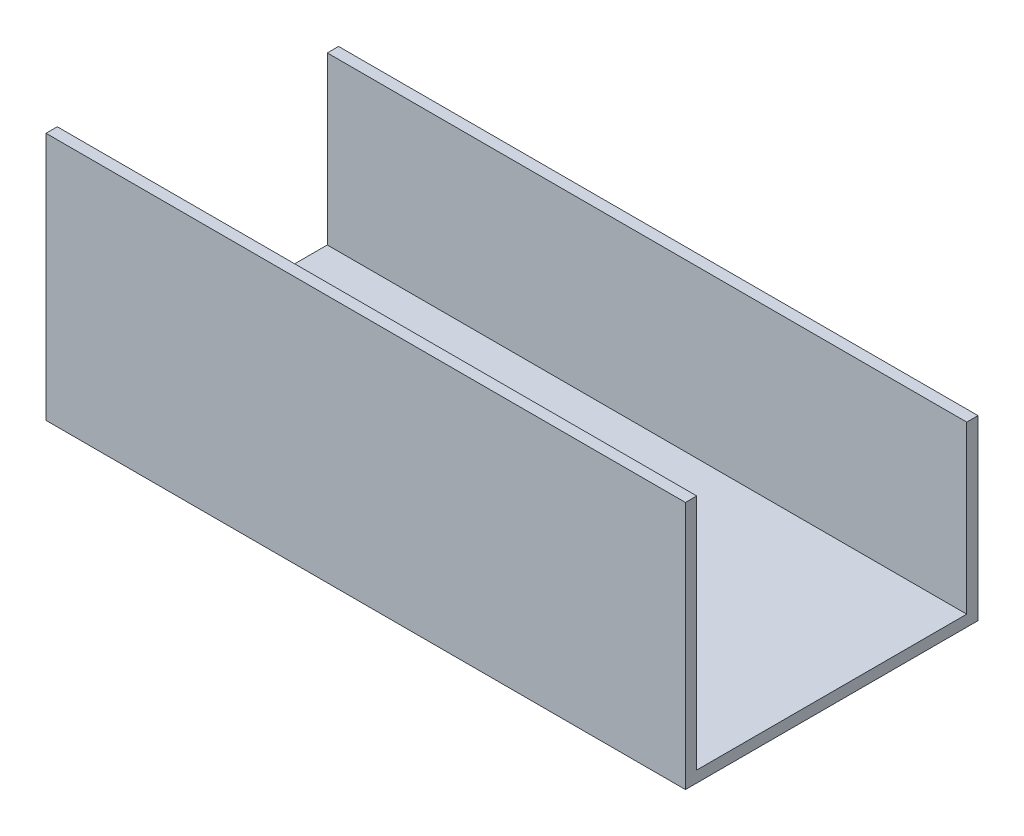
ISO-10303-21;
HEADER;
FILE_DESCRIPTION(('STEP AP214'),'2;1');
FILE_NAME('part.step','',(''),(''),'','','');
FILE_SCHEMA(('AUTOMOTIVE_DESIGN { 1 0 10303 214 1 1 1 1 }'));
ENDSEC;
DATA;
#1=APPLICATION_CONTEXT('core data for automotive mechanical design processes');
#2=APPLICATION_PROTOCOL_DEFINITION('international standard','automotive_design',2000,#1);
#3=PRODUCT_CONTEXT('',#1,'mechanical');
#4=PRODUCT('Part','Part','',(#3));
#5=PRODUCT_RELATED_PRODUCT_CATEGORY('part','',(#4));
#6=PRODUCT_DEFINITION_FORMATION('','',#4);
#7=PRODUCT_DEFINITION_CONTEXT('part definition',#1,'design');
#8=PRODUCT_DEFINITION('design','',#6,#7);
#9=PRODUCT_DEFINITION_SHAPE('','',#8);
#10=(LENGTH_UNIT() NAMED_UNIT(*) SI_UNIT(.MILLI.,.METRE.));
#11=(NAMED_UNIT(*) PLANE_ANGLE_UNIT() SI_UNIT($,.RADIAN.));
#12=(NAMED_UNIT(*) SI_UNIT($,.STERADIAN.) SOLID_ANGLE_UNIT());
#13=UNCERTAINTY_MEASURE_WITH_UNIT(LENGTH_MEASURE(1.E-05),#10,'distance_accuracy_value','');
#14=(GEOMETRIC_REPRESENTATION_CONTEXT(3) GLOBAL_UNCERTAINTY_ASSIGNED_CONTEXT((#13)) GLOBAL_UNIT_ASSIGNED_CONTEXT((#10,
#11,#12)) REPRESENTATION_CONTEXT('',''));
#15=CARTESIAN_POINT('',(0.,0.,0.));
#16=DIRECTION('',(0.,0.,1.));
#17=DIRECTION('',(1.,0.,0.));
#18=AXIS2_PLACEMENT_3D('',#15,#16,#17);
#19=CARTESIAN_POINT('',(180.,0.,3.18));
#20=DIRECTION('',(0.,-1.,0.));
#21=DIRECTION('',(0.,0.,-1.));
#22=AXIS2_PLACEMENT_3D('',#19,#20,#21);
#23=PLANE('',#22);
#24=DIRECTION('',(0.,0.,1.));
#25=VECTOR('',#24,1.);
#26=CARTESIAN_POINT('',(0.,0.,3.18));
#27=LINE('',#26,#25);
#28=CARTESIAN_POINT('',(0.,0.,0.));
#29=VERTEX_POINT('',#28);
#30=CARTESIAN_POINT('',(0.,0.,3.18));
#31=VERTEX_POINT('',#30);
#32=EDGE_CURVE('E134',#29,#31,#27,.T.);
#33=ORIENTED_EDGE('',*,*,#32,.T.);
#34=DIRECTION('',(-1.,0.,0.));
#35=VECTOR('',#34,1.);
#36=CARTESIAN_POINT('',(180.,0.,3.18));
#37=LINE('',#36,#35);
#38=CARTESIAN_POINT('',(180.,0.,3.18));
#39=VERTEX_POINT('',#38);
#40=EDGE_CURVE('E11',#39,#31,#37,.T.);
#41=ORIENTED_EDGE('',*,*,#40,.F.);
#42=DIRECTION('',(0.,0.,1.));
#43=VECTOR('',#42,1.);
#44=CARTESIAN_POINT('',(180.,0.,3.18));
#45=LINE('',#44,#43);
#46=CARTESIAN_POINT('',(180.,0.,0.));
#47=VERTEX_POINT('',#46);
#48=EDGE_CURVE('E146',#47,#39,#45,.T.);
#49=ORIENTED_EDGE('',*,*,#48,.F.);
#50=DIRECTION('',(-1.,0.,0.));
#51=VECTOR('',#50,1.);
#52=CARTESIAN_POINT('',(180.,0.,0.));
#53=LINE('',#52,#51);
#54=EDGE_CURVE('E131',#47,#29,#53,.T.);
#55=ORIENTED_EDGE('',*,*,#54,.T.);
#56=EDGE_LOOP('',(#33,#41,#49,#55));
#57=FACE_BOUND('',#56,.T.);
#58=ADVANCED_FACE('F39',(#57),#23,.F.);
#59=CARTESIAN_POINT('',(180.,-70.,3.18));
#60=DIRECTION('',(0.,0.,-1.));
#61=DIRECTION('',(-1.,0.,0.));
#62=AXIS2_PLACEMENT_3D('',#59,#60,#61);
#63=PLANE('',#62);
#64=DIRECTION('',(0.,-1.,0.));
#65=VECTOR('',#64,1.);
#66=CARTESIAN_POINT('',(0.,-70.,3.18));
#67=LINE('',#66,#65);
#68=CARTESIAN_POINT('',(0.,-70.,3.18));
#69=VERTEX_POINT('',#68);
#70=EDGE_CURVE('E138',#31,#69,#67,.T.);
#71=ORIENTED_EDGE('',*,*,#70,.T.);
#72=DIRECTION('',(-1.,0.,0.));
#73=VECTOR('',#72,1.);
#74=CARTESIAN_POINT('',(180.,-70.,3.18));
#75=LINE('',#74,#73);
#76=CARTESIAN_POINT('',(180.,-70.,3.18));
#77=VERTEX_POINT('',#76);
#78=EDGE_CURVE('E50',#77,#69,#75,.T.);
#79=ORIENTED_EDGE('',*,*,#78,.F.);
#80=DIRECTION('',(0.,-1.,0.));
#81=VECTOR('',#80,1.);
#82=CARTESIAN_POINT('',(180.,-70.,3.18));
#83=LINE('',#82,#81);
#84=EDGE_CURVE('E97',#39,#77,#83,.T.);
#85=ORIENTED_EDGE('',*,*,#84,.F.);
#86=ORIENTED_EDGE('',*,*,#40,.T.);
#87=EDGE_LOOP('',(#71,#79,#85,#86));
#88=FACE_BOUND('',#87,.T.);
#89=ADVANCED_FACE('F182',(#88),#63,.F.);
#90=CARTESIAN_POINT('',(180.,-70.,-79.175));
#91=DIRECTION('',(0.,1.,0.));
#92=DIRECTION('',(0.,0.,1.));
#93=AXIS2_PLACEMENT_3D('',#90,#91,#92);
#94=PLANE('',#93);
#95=DIRECTION('',(0.,0.,-1.));
#96=VECTOR('',#95,1.);
#97=CARTESIAN_POINT('',(0.,-70.,-79.175));
#98=LINE('',#97,#96);
#99=CARTESIAN_POINT('',(0.,-70.,-79.175));
#100=VERTEX_POINT('',#99);
#101=EDGE_CURVE('E139',#69,#100,#98,.T.);
#102=ORIENTED_EDGE('',*,*,#101,.T.);
#103=DIRECTION('',(-1.,0.,0.));
#104=VECTOR('',#103,1.);
#105=CARTESIAN_POINT('',(180.,-70.,-79.175));
#106=LINE('',#105,#104);
#107=CARTESIAN_POINT('',(180.,-70.,-79.175));
#108=VERTEX_POINT('',#107);
#109=EDGE_CURVE('E157',#108,#100,#106,.T.);
#110=ORIENTED_EDGE('',*,*,#109,.F.);
#111=DIRECTION('',(0.,0.,-1.));
#112=VECTOR('',#111,1.);
#113=CARTESIAN_POINT('',(180.,-70.,-79.175));
#114=LINE('',#113,#112);
#115=EDGE_CURVE('E161',#77,#108,#114,.T.);
#116=ORIENTED_EDGE('',*,*,#115,.F.);
#117=ORIENTED_EDGE('',*,*,#78,.T.);
#118=EDGE_LOOP('',(#102,#110,#116,#117));
#119=FACE_BOUND('',#118,.T.);
#120=ADVANCED_FACE('F164',(#119),#94,.F.);
#121=CARTESIAN_POINT('',(180.,-20.,-79.175));
#122=DIRECTION('',(0.,0.,1.));
#123=DIRECTION('',(1.,0.,0.));
#124=AXIS2_PLACEMENT_3D('',#121,#122,#123);
#125=PLANE('',#124);
#126=DIRECTION('',(0.,1.,0.));
#127=VECTOR('',#126,1.);
#128=CARTESIAN_POINT('',(0.,-20.,-79.175));
#129=LINE('',#128,#127);
#130=CARTESIAN_POINT('',(0.,-20.,-79.175));
#131=VERTEX_POINT('',#130);
#132=EDGE_CURVE('E145',#100,#131,#129,.T.);
#133=ORIENTED_EDGE('',*,*,#132,.T.);
#134=DIRECTION('',(-1.,0.,0.));
#135=VECTOR('',#134,1.);
#136=CARTESIAN_POINT('',(180.,-20.,-79.175));
#137=LINE('',#136,#135);
#138=CARTESIAN_POINT('',(180.,-20.,-79.175));
#139=VERTEX_POINT('',#138);
#140=EDGE_CURVE('E155',#139,#131,#137,.T.);
#141=ORIENTED_EDGE('',*,*,#140,.F.);
#142=DIRECTION('',(0.,1.,0.));
#143=VECTOR('',#142,1.);
#144=CARTESIAN_POINT('',(180.,-20.,-79.175));
#145=LINE('',#144,#143);
#146=EDGE_CURVE('E176',#108,#139,#145,.T.);
#147=ORIENTED_EDGE('',*,*,#146,.F.);
#148=ORIENTED_EDGE('',*,*,#109,.T.);
#149=EDGE_LOOP('',(#133,#141,#147,#148));
#150=FACE_BOUND('',#149,.T.);
#151=ADVANCED_FACE('F175',(#150),#125,.F.);
#152=CARTESIAN_POINT('',(180.,-20.,-76.));
#153=DIRECTION('',(0.,-1.,0.));
#154=DIRECTION('',(0.,0.,-1.));
#155=AXIS2_PLACEMENT_3D('',#152,#153,#154);
#156=PLANE('',#155);
#157=DIRECTION('',(0.,0.,1.));
#158=VECTOR('',#157,1.);
#159=CARTESIAN_POINT('',(0.,-20.,-76.));
#160=LINE('',#159,#158);
#161=CARTESIAN_POINT('',(0.,-20.,-76.));
#162=VERTEX_POINT('',#161);
#163=EDGE_CURVE('E143',#131,#162,#160,.T.);
#164=ORIENTED_EDGE('',*,*,#163,.T.);
#165=DIRECTION('',(-1.,0.,0.));
#166=VECTOR('',#165,1.);
#167=CARTESIAN_POINT('',(180.,-20.,-76.));
#168=LINE('',#167,#166);
#169=CARTESIAN_POINT('',(180.,-20.,-76.));
#170=VERTEX_POINT('',#169);
#171=EDGE_CURVE('E128',#170,#162,#168,.T.);
#172=ORIENTED_EDGE('',*,*,#171,.F.);
#173=DIRECTION('',(0.,0.,1.));
#174=VECTOR('',#173,1.);
#175=CARTESIAN_POINT('',(180.,-20.,-76.));
#176=LINE('',#175,#174);
#177=EDGE_CURVE('E119',#139,#170,#176,.T.);
#178=ORIENTED_EDGE('',*,*,#177,.F.);
#179=ORIENTED_EDGE('',*,*,#140,.T.);
#180=EDGE_LOOP('',(#164,#172,#178,#179));
#181=FACE_BOUND('',#180,.T.);
#182=ADVANCED_FACE('F172',(#181),#156,.F.);
#183=CARTESIAN_POINT('',(180.,-66.82,-76.));
#184=DIRECTION('',(0.,0.,-1.));
#185=DIRECTION('',(0.,1.,0.));
#186=AXIS2_PLACEMENT_3D('',#183,#184,#185);
#187=PLANE('',#186);
#188=DIRECTION('',(0.,-1.,0.));
#189=VECTOR('',#188,1.);
#190=CARTESIAN_POINT('',(0.,-66.82,-76.));
#191=LINE('',#190,#189);
#192=CARTESIAN_POINT('',(0.,-66.82,-76.));
#193=VERTEX_POINT('',#192);
#194=EDGE_CURVE('E124',#162,#193,#191,.T.);
#195=ORIENTED_EDGE('',*,*,#194,.T.);
#196=DIRECTION('',(-1.,0.,0.));
#197=VECTOR('',#196,1.);
#198=CARTESIAN_POINT('',(180.,-66.82,-76.));
#199=LINE('',#198,#197);
#200=CARTESIAN_POINT('',(180.,-66.82,-76.));
#201=VERTEX_POINT('',#200);
#202=EDGE_CURVE('E122',#201,#193,#199,.T.);
#203=ORIENTED_EDGE('',*,*,#202,.F.);
#204=DIRECTION('',(0.,-1.,0.));
#205=VECTOR('',#204,1.);
#206=CARTESIAN_POINT('',(180.,-66.82,-76.));
#207=LINE('',#206,#205);
#208=EDGE_CURVE('E112',#170,#201,#207,.T.);
#209=ORIENTED_EDGE('',*,*,#208,.F.);
#210=ORIENTED_EDGE('',*,*,#171,.T.);
#211=EDGE_LOOP('',(#195,#203,#209,#210));
#212=FACE_BOUND('',#211,.T.);
#213=ADVANCED_FACE('F121',(#212),#187,.F.);
#214=CARTESIAN_POINT('',(180.,-66.82,0.));
#215=DIRECTION('',(0.,-1.,0.));
#216=DIRECTION('',(0.,0.,-1.));
#217=AXIS2_PLACEMENT_3D('',#214,#215,#216);
#218=PLANE('',#217);
#219=DIRECTION('',(0.,0.,1.));
#220=VECTOR('',#219,1.);
#221=CARTESIAN_POINT('',(0.,-66.82,0.));
#222=LINE('',#221,#220);
#223=CARTESIAN_POINT('',(0.,-66.82,0.));
#224=VERTEX_POINT('',#223);
#225=EDGE_CURVE('E84',#193,#224,#222,.T.);
#226=ORIENTED_EDGE('',*,*,#225,.T.);
#227=DIRECTION('',(-1.,0.,0.));
#228=VECTOR('',#227,1.);
#229=CARTESIAN_POINT('',(180.,-66.82,0.));
#230=LINE('',#229,#228);
#231=CARTESIAN_POINT('',(180.,-66.82,0.));
#232=VERTEX_POINT('',#231);
#233=EDGE_CURVE('E130',#232,#224,#230,.T.);
#234=ORIENTED_EDGE('',*,*,#233,.F.);
#235=DIRECTION('',(0.,0.,1.));
#236=VECTOR('',#235,1.);
#237=CARTESIAN_POINT('',(180.,-66.82,0.));
#238=LINE('',#237,#236);
#239=EDGE_CURVE('E113',#201,#232,#238,.T.);
#240=ORIENTED_EDGE('',*,*,#239,.F.);
#241=ORIENTED_EDGE('',*,*,#202,.T.);
#242=EDGE_LOOP('',(#226,#234,#240,#241));
#243=FACE_BOUND('',#242,.T.);
#244=ADVANCED_FACE('F129',(#243),#218,.F.);
#245=CARTESIAN_POINT('',(180.,0.,0.));
#246=DIRECTION('',(0.,0.,1.));
#247=DIRECTION('',(0.,-1.,0.));
#248=AXIS2_PLACEMENT_3D('',#245,#246,#247);
#249=PLANE('',#248);
#250=DIRECTION('',(0.,1.,0.));
#251=VECTOR('',#250,1.);
#252=CARTESIAN_POINT('',(0.,0.,0.));
#253=LINE('',#252,#251);
#254=EDGE_CURVE('E89',#224,#29,#253,.T.);
#255=ORIENTED_EDGE('',*,*,#254,.T.);
#256=ORIENTED_EDGE('',*,*,#54,.F.);
#257=DIRECTION('',(0.,1.,0.));
#258=VECTOR('',#257,1.);
#259=CARTESIAN_POINT('',(180.,0.,0.));
#260=LINE('',#259,#258);
#261=EDGE_CURVE('E54',#232,#47,#260,.T.);
#262=ORIENTED_EDGE('',*,*,#261,.F.);
#263=ORIENTED_EDGE('',*,*,#233,.T.);
#264=EDGE_LOOP('',(#255,#256,#262,#263));
#265=FACE_BOUND('',#264,.T.);
#266=ADVANCED_FACE('F198',(#265),#249,.F.);
#267=CARTESIAN_POINT('',(180.,0.,0.));
#268=DIRECTION('',(-1.,0.,0.));
#269=DIRECTION('',(0.,0.,1.));
#270=AXIS2_PLACEMENT_3D('',#267,#268,#269);
#271=PLANE('',#270);
#272=ORIENTED_EDGE('',*,*,#48,.T.);
#273=ORIENTED_EDGE('',*,*,#84,.T.);
#274=ORIENTED_EDGE('',*,*,#115,.T.);
#275=ORIENTED_EDGE('',*,*,#146,.T.);
#276=ORIENTED_EDGE('',*,*,#177,.T.);
#277=ORIENTED_EDGE('',*,*,#208,.T.);
#278=ORIENTED_EDGE('',*,*,#239,.T.);
#279=ORIENTED_EDGE('',*,*,#261,.T.);
#280=EDGE_LOOP('',(#272,#273,#274,#275,#276,#277,#278,#279));
#281=FACE_BOUND('',#280,.T.);
#282=ADVANCED_FACE('F111',(#281),#271,.F.);
#283=CARTESIAN_POINT('',(0.,0.,0.));
#284=DIRECTION('',(-1.,0.,0.));
#285=DIRECTION('',(0.,0.,1.));
#286=AXIS2_PLACEMENT_3D('',#283,#284,#285);
#287=PLANE('',#286);
#288=ORIENTED_EDGE('',*,*,#32,.F.);
#289=ORIENTED_EDGE('',*,*,#254,.F.);
#290=ORIENTED_EDGE('',*,*,#225,.F.);
#291=ORIENTED_EDGE('',*,*,#194,.F.);
#292=ORIENTED_EDGE('',*,*,#163,.F.);
#293=ORIENTED_EDGE('',*,*,#132,.F.);
#294=ORIENTED_EDGE('',*,*,#101,.F.);
#295=ORIENTED_EDGE('',*,*,#70,.F.);
#296=EDGE_LOOP('',(#288,#289,#290,#291,#292,#293,#294,#295));
#297=FACE_BOUND('',#296,.T.);
#298=ADVANCED_FACE('F166',(#297),#287,.T.);
#299=CLOSED_SHELL('',(#58,#89,#120,#151,#182,#213,#244,#266,#282,#298));
#300=MANIFOLD_SOLID_BREP('B2',#299);
#301=ADVANCED_BREP_SHAPE_REPRESENTATION('',(#18,#300),#14);
#302=SHAPE_DEFINITION_REPRESENTATION(#9,#301);
ENDSEC;
END-ISO-10303-21;
